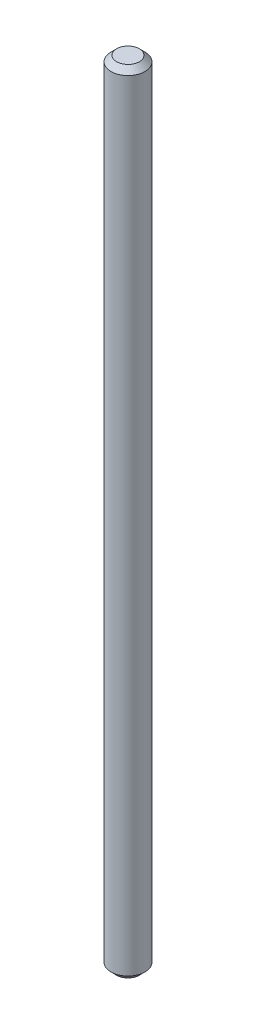
ISO-10303-21;
HEADER;
FILE_DESCRIPTION(('STEP AP214'),'2;1');
FILE_NAME('part.step','',(''),(''),'','','');
FILE_SCHEMA(('AUTOMOTIVE_DESIGN { 1 0 10303 214 1 1 1 1 }'));
ENDSEC;
DATA;
#1=APPLICATION_CONTEXT('core data for automotive mechanical design processes');
#2=APPLICATION_PROTOCOL_DEFINITION('international standard','automotive_design',2000,#1);
#3=PRODUCT_CONTEXT('',#1,'mechanical');
#4=PRODUCT('Part','Part','',(#3));
#5=PRODUCT_RELATED_PRODUCT_CATEGORY('part','',(#4));
#6=PRODUCT_DEFINITION_FORMATION('','',#4);
#7=PRODUCT_DEFINITION_CONTEXT('part definition',#1,'design');
#8=PRODUCT_DEFINITION('design','',#6,#7);
#9=PRODUCT_DEFINITION_SHAPE('','',#8);
#10=(LENGTH_UNIT() NAMED_UNIT(*) SI_UNIT(.MILLI.,.METRE.));
#11=(NAMED_UNIT(*) PLANE_ANGLE_UNIT() SI_UNIT($,.RADIAN.));
#12=(NAMED_UNIT(*) SI_UNIT($,.STERADIAN.) SOLID_ANGLE_UNIT());
#13=UNCERTAINTY_MEASURE_WITH_UNIT(LENGTH_MEASURE(1.E-05),#10,'distance_accuracy_value','');
#14=(GEOMETRIC_REPRESENTATION_CONTEXT(3) GLOBAL_UNCERTAINTY_ASSIGNED_CONTEXT((#13)) GLOBAL_UNIT_ASSIGNED_CONTEXT((#10,
#11,#12)) REPRESENTATION_CONTEXT('',''));
#15=CARTESIAN_POINT('',(0.,0.,0.));
#16=DIRECTION('',(0.,0.,1.));
#17=DIRECTION('',(1.,0.,0.));
#18=AXIS2_PLACEMENT_3D('',#15,#16,#17);
#19=CARTESIAN_POINT('',(0.,70.,0.));
#20=DIRECTION('',(0.,-1.,0.));
#21=DIRECTION('',(0.,0.,-1.));
#22=AXIS2_PLACEMENT_3D('',#19,#20,#21);
#23=CYLINDRICAL_SURFACE('',#22,1.5);
#24=CARTESIAN_POINT('',(0.,0.5,0.));
#25=DIRECTION('',(0.,1.,0.));
#26=DIRECTION('',(0.,0.,1.));
#27=AXIS2_PLACEMENT_3D('',#24,#25,#26);
#28=CIRCLE('',#27,1.5);
#29=CARTESIAN_POINT('',(0.,0.5,1.5));
#30=VERTEX_POINT('',#29);
#31=EDGE_CURVE('E57',#30,#30,#28,.T.);
#32=ORIENTED_EDGE('',*,*,#31,.T.);
#33=EDGE_LOOP('',(#32));
#34=FACE_BOUND('',#33,.T.);
#35=CARTESIAN_POINT('',(0.,69.5,0.));
#36=DIRECTION('',(0.,1.,0.));
#37=DIRECTION('',(0.,0.,1.));
#38=AXIS2_PLACEMENT_3D('',#35,#36,#37);
#39=CIRCLE('',#38,1.5);
#40=CARTESIAN_POINT('',(0.,69.5,1.5));
#41=VERTEX_POINT('',#40);
#42=EDGE_CURVE('E62',#41,#41,#39,.F.);
#43=ORIENTED_EDGE('',*,*,#42,.T.);
#44=EDGE_LOOP('',(#43));
#45=FACE_BOUND('',#44,.T.);
#46=ADVANCED_FACE('F43',(#34,#45),#23,.T.);
#47=CARTESIAN_POINT('',(0.,70.,0.));
#48=DIRECTION('',(0.,1.,0.));
#49=DIRECTION('',(0.,0.,1.));
#50=AXIS2_PLACEMENT_3D('',#47,#48,#49);
#51=PLANE('',#50);
#52=CARTESIAN_POINT('',(0.,70.,0.));
#53=DIRECTION('',(0.,1.,0.));
#54=DIRECTION('',(0.,0.,1.));
#55=AXIS2_PLACEMENT_3D('',#52,#53,#54);
#56=CIRCLE('',#55,0.999999999999994);
#57=CARTESIAN_POINT('',(0.,70.,0.999999999999994));
#58=VERTEX_POINT('',#57);
#59=EDGE_CURVE('E10',#58,#58,#56,.T.);
#60=ORIENTED_EDGE('',*,*,#59,.T.);
#61=EDGE_LOOP('',(#60));
#62=FACE_BOUND('',#61,.T.);
#63=ADVANCED_FACE('F79',(#62),#51,.T.);
#64=CARTESIAN_POINT('',(0.,0.,0.));
#65=DIRECTION('',(0.,1.,0.));
#66=DIRECTION('',(0.,0.,1.));
#67=AXIS2_PLACEMENT_3D('',#64,#65,#66);
#68=PLANE('',#67);
#69=CARTESIAN_POINT('',(0.,0.,0.));
#70=DIRECTION('',(0.,1.,0.));
#71=DIRECTION('',(0.,0.,1.));
#72=AXIS2_PLACEMENT_3D('',#69,#70,#71);
#73=CIRCLE('',#72,1.);
#74=CARTESIAN_POINT('',(0.,0.,1.));
#75=VERTEX_POINT('',#74);
#76=EDGE_CURVE('E52',#75,#75,#73,.F.);
#77=ORIENTED_EDGE('',*,*,#76,.T.);
#78=EDGE_LOOP('',(#77));
#79=FACE_BOUND('',#78,.T.);
#80=ADVANCED_FACE('F76',(#79),#68,.F.);
#81=CARTESIAN_POINT('',(0.,0.5,0.));
#82=DIRECTION('',(0.,1.,0.));
#83=DIRECTION('',(0.,0.,1.));
#84=AXIS2_PLACEMENT_3D('',#81,#82,#83);
#85=CONICAL_SURFACE('',#84,1.5,0.785398163397447);
#86=ORIENTED_EDGE('',*,*,#76,.F.);
#87=EDGE_LOOP('',(#86));
#88=FACE_BOUND('',#87,.T.);
#89=ORIENTED_EDGE('',*,*,#31,.F.);
#90=EDGE_LOOP('',(#89));
#91=FACE_BOUND('',#90,.T.);
#92=ADVANCED_FACE('F72',(#88,#91),#85,.T.);
#93=CARTESIAN_POINT('',(0.,70.,0.));
#94=DIRECTION('',(0.,-1.,0.));
#95=DIRECTION('',(0.,0.,-1.));
#96=AXIS2_PLACEMENT_3D('',#93,#94,#95);
#97=CONICAL_SURFACE('',#96,0.999999999999994,0.785398163397454);
#98=ORIENTED_EDGE('',*,*,#42,.F.);
#99=EDGE_LOOP('',(#98));
#100=FACE_BOUND('',#99,.T.);
#101=ORIENTED_EDGE('',*,*,#59,.F.);
#102=EDGE_LOOP('',(#101));
#103=FACE_BOUND('',#102,.T.);
#104=ADVANCED_FACE('F46',(#100,#103),#97,.T.);
#105=CLOSED_SHELL('',(#46,#63,#80,#92,#104));
#106=MANIFOLD_SOLID_BREP('B2',#105);
#107=ADVANCED_BREP_SHAPE_REPRESENTATION('',(#18,#106),#14);
#108=SHAPE_DEFINITION_REPRESENTATION(#9,#107);
ENDSEC;
END-ISO-10303-21;
